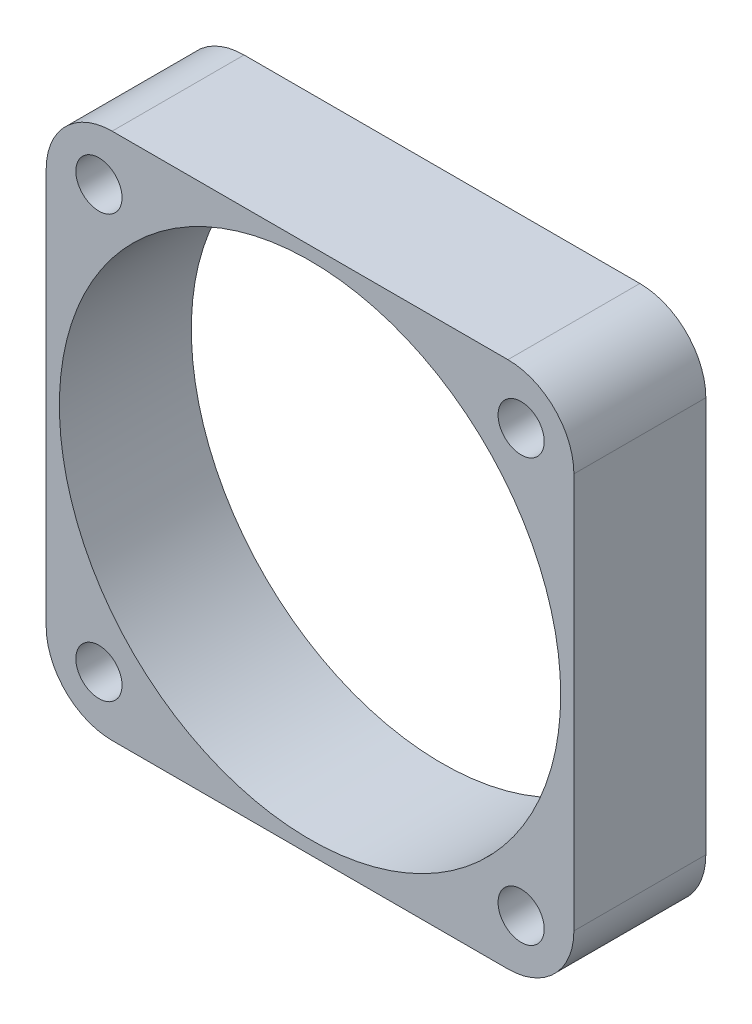
ISO-10303-21;
HEADER;
FILE_DESCRIPTION(('STEP AP214'),'2;1');
FILE_NAME('part.step','',(''),(''),'','','');
FILE_SCHEMA(('AUTOMOTIVE_DESIGN { 1 0 10303 214 1 1 1 1 }'));
ENDSEC;
DATA;
#1=APPLICATION_CONTEXT('core data for automotive mechanical design processes');
#2=APPLICATION_PROTOCOL_DEFINITION('international standard','automotive_design',2000,#1);
#3=PRODUCT_CONTEXT('',#1,'mechanical');
#4=PRODUCT('Part','Part','',(#3));
#5=PRODUCT_RELATED_PRODUCT_CATEGORY('part','',(#4));
#6=PRODUCT_DEFINITION_FORMATION('','',#4);
#7=PRODUCT_DEFINITION_CONTEXT('part definition',#1,'design');
#8=PRODUCT_DEFINITION('design','',#6,#7);
#9=PRODUCT_DEFINITION_SHAPE('','',#8);
#10=(LENGTH_UNIT() NAMED_UNIT(*) SI_UNIT(.MILLI.,.METRE.));
#11=(NAMED_UNIT(*) PLANE_ANGLE_UNIT() SI_UNIT($,.RADIAN.));
#12=(NAMED_UNIT(*) SI_UNIT($,.STERADIAN.) SOLID_ANGLE_UNIT());
#13=UNCERTAINTY_MEASURE_WITH_UNIT(LENGTH_MEASURE(1.E-05),#10,'distance_accuracy_value','');
#14=(GEOMETRIC_REPRESENTATION_CONTEXT(3) GLOBAL_UNCERTAINTY_ASSIGNED_CONTEXT((#13)) GLOBAL_UNIT_ASSIGNED_CONTEXT((#10,
#11,#12)) REPRESENTATION_CONTEXT('',''));
#15=CARTESIAN_POINT('',(0.,0.,0.));
#16=DIRECTION('',(0.,0.,1.));
#17=DIRECTION('',(1.,0.,0.));
#18=AXIS2_PLACEMENT_3D('',#15,#16,#17);
#19=CARTESIAN_POINT('',(0.,0.,10.));
#20=DIRECTION('',(1.,0.,0.));
#21=DIRECTION('',(0.,0.,-1.));
#22=AXIS2_PLACEMENT_3D('',#19,#20,#21);
#23=PLANE('',#22);
#24=DIRECTION('',(0.,-1.,0.));
#25=VECTOR('',#24,1.);
#26=CARTESIAN_POINT('',(0.,0.,0.));
#27=LINE('',#26,#25);
#28=CARTESIAN_POINT('',(0.,35.,0.));
#29=VERTEX_POINT('',#28);
#30=CARTESIAN_POINT('',(0.,5.,0.));
#31=VERTEX_POINT('',#30);
#32=EDGE_CURVE('E177',#29,#31,#27,.T.);
#33=ORIENTED_EDGE('',*,*,#32,.T.);
#34=DIRECTION('',(0.,0.,-1.));
#35=VECTOR('',#34,1.);
#36=CARTESIAN_POINT('',(0.,5.,10.));
#37=LINE('',#36,#35);
#38=CARTESIAN_POINT('',(0.,5.,10.));
#39=VERTEX_POINT('',#38);
#40=EDGE_CURVE('E152',#31,#39,#37,.F.);
#41=ORIENTED_EDGE('',*,*,#40,.T.);
#42=DIRECTION('',(0.,-1.,0.));
#43=VECTOR('',#42,1.);
#44=CARTESIAN_POINT('',(0.,0.,10.));
#45=LINE('',#44,#43);
#46=CARTESIAN_POINT('',(0.,35.,10.));
#47=VERTEX_POINT('',#46);
#48=EDGE_CURVE('E191',#47,#39,#45,.T.);
#49=ORIENTED_EDGE('',*,*,#48,.F.);
#50=DIRECTION('',(0.,0.,-1.));
#51=VECTOR('',#50,1.);
#52=CARTESIAN_POINT('',(0.,35.,10.));
#53=LINE('',#52,#51);
#54=EDGE_CURVE('E158',#47,#29,#53,.T.);
#55=ORIENTED_EDGE('',*,*,#54,.T.);
#56=EDGE_LOOP('',(#33,#41,#49,#55));
#57=FACE_BOUND('',#56,.T.);
#58=ADVANCED_FACE('F68',(#57),#23,.F.);
#59=CARTESIAN_POINT('',(0.,0.,10.));
#60=DIRECTION('',(0.,1.,0.));
#61=DIRECTION('',(0.,0.,1.));
#62=AXIS2_PLACEMENT_3D('',#59,#60,#61);
#63=PLANE('',#62);
#64=DIRECTION('',(1.,0.,0.));
#65=VECTOR('',#64,1.);
#66=CARTESIAN_POINT('',(0.,0.,10.));
#67=LINE('',#66,#65);
#68=CARTESIAN_POINT('',(5.,0.,10.));
#69=VERTEX_POINT('',#68);
#70=CARTESIAN_POINT('',(35.,0.,10.));
#71=VERTEX_POINT('',#70);
#72=EDGE_CURVE('E168',#69,#71,#67,.T.);
#73=ORIENTED_EDGE('',*,*,#72,.F.);
#74=DIRECTION('',(0.,0.,-1.));
#75=VECTOR('',#74,1.);
#76=CARTESIAN_POINT('',(5.,0.,10.));
#77=LINE('',#76,#75);
#78=CARTESIAN_POINT('',(5.,0.,0.));
#79=VERTEX_POINT('',#78);
#80=EDGE_CURVE('E151',#69,#79,#77,.T.);
#81=ORIENTED_EDGE('',*,*,#80,.T.);
#82=DIRECTION('',(1.,0.,0.));
#83=VECTOR('',#82,1.);
#84=CARTESIAN_POINT('',(0.,0.,0.));
#85=LINE('',#84,#83);
#86=CARTESIAN_POINT('',(35.,0.,0.));
#87=VERTEX_POINT('',#86);
#88=EDGE_CURVE('E165',#79,#87,#85,.T.);
#89=ORIENTED_EDGE('',*,*,#88,.T.);
#90=DIRECTION('',(0.,0.,-1.));
#91=VECTOR('',#90,1.);
#92=CARTESIAN_POINT('',(35.,0.,10.));
#93=LINE('',#92,#91);
#94=EDGE_CURVE('E171',#87,#71,#93,.F.);
#95=ORIENTED_EDGE('',*,*,#94,.T.);
#96=EDGE_LOOP('',(#73,#81,#89,#95));
#97=FACE_BOUND('',#96,.T.);
#98=ADVANCED_FACE('F164',(#97),#63,.F.);
#99=CARTESIAN_POINT('',(40.,0.,10.));
#100=DIRECTION('',(-1.,0.,0.));
#101=DIRECTION('',(0.,0.,1.));
#102=AXIS2_PLACEMENT_3D('',#99,#100,#101);
#103=PLANE('',#102);
#104=DIRECTION('',(0.,1.,0.));
#105=VECTOR('',#104,1.);
#106=CARTESIAN_POINT('',(40.,0.,10.));
#107=LINE('',#106,#105);
#108=CARTESIAN_POINT('',(40.,5.,10.));
#109=VERTEX_POINT('',#108);
#110=CARTESIAN_POINT('',(40.,35.,10.));
#111=VERTEX_POINT('',#110);
#112=EDGE_CURVE('E239',#109,#111,#107,.T.);
#113=ORIENTED_EDGE('',*,*,#112,.F.);
#114=DIRECTION('',(0.,0.,-1.));
#115=VECTOR('',#114,1.);
#116=CARTESIAN_POINT('',(40.,5.,10.));
#117=LINE('',#116,#115);
#118=CARTESIAN_POINT('',(40.,5.,0.));
#119=VERTEX_POINT('',#118);
#120=EDGE_CURVE('E219',#109,#119,#117,.T.);
#121=ORIENTED_EDGE('',*,*,#120,.T.);
#122=DIRECTION('',(0.,1.,0.));
#123=VECTOR('',#122,1.);
#124=CARTESIAN_POINT('',(40.,0.,0.));
#125=LINE('',#124,#123);
#126=CARTESIAN_POINT('',(40.,35.,0.));
#127=VERTEX_POINT('',#126);
#128=EDGE_CURVE('E176',#119,#127,#125,.T.);
#129=ORIENTED_EDGE('',*,*,#128,.T.);
#130=DIRECTION('',(0.,0.,-1.));
#131=VECTOR('',#130,1.);
#132=CARTESIAN_POINT('',(40.,35.,10.));
#133=LINE('',#132,#131);
#134=EDGE_CURVE('E216',#127,#111,#133,.F.);
#135=ORIENTED_EDGE('',*,*,#134,.T.);
#136=EDGE_LOOP('',(#113,#121,#129,#135));
#137=FACE_BOUND('',#136,.T.);
#138=ADVANCED_FACE('F258',(#137),#103,.F.);
#139=CARTESIAN_POINT('',(0.,40.,10.));
#140=DIRECTION('',(0.,-1.,0.));
#141=DIRECTION('',(0.,0.,-1.));
#142=AXIS2_PLACEMENT_3D('',#139,#140,#141);
#143=PLANE('',#142);
#144=DIRECTION('',(-1.,0.,0.));
#145=VECTOR('',#144,1.);
#146=CARTESIAN_POINT('',(0.,40.,0.));
#147=LINE('',#146,#145);
#148=CARTESIAN_POINT('',(35.,40.,0.));
#149=VERTEX_POINT('',#148);
#150=CARTESIAN_POINT('',(5.,40.,0.));
#151=VERTEX_POINT('',#150);
#152=EDGE_CURVE('E182',#149,#151,#147,.T.);
#153=ORIENTED_EDGE('',*,*,#152,.T.);
#154=DIRECTION('',(0.,0.,-1.));
#155=VECTOR('',#154,1.);
#156=CARTESIAN_POINT('',(5.,40.,10.));
#157=LINE('',#156,#155);
#158=CARTESIAN_POINT('',(5.,40.,10.));
#159=VERTEX_POINT('',#158);
#160=EDGE_CURVE('E12',#151,#159,#157,.F.);
#161=ORIENTED_EDGE('',*,*,#160,.T.);
#162=DIRECTION('',(-1.,0.,0.));
#163=VECTOR('',#162,1.);
#164=CARTESIAN_POINT('',(0.,40.,10.));
#165=LINE('',#164,#163);
#166=CARTESIAN_POINT('',(35.,40.,10.));
#167=VERTEX_POINT('',#166);
#168=EDGE_CURVE('E193',#167,#159,#165,.T.);
#169=ORIENTED_EDGE('',*,*,#168,.F.);
#170=DIRECTION('',(0.,0.,-1.));
#171=VECTOR('',#170,1.);
#172=CARTESIAN_POINT('',(35.,40.,10.));
#173=LINE('',#172,#171);
#174=EDGE_CURVE('E76',#167,#149,#173,.T.);
#175=ORIENTED_EDGE('',*,*,#174,.T.);
#176=EDGE_LOOP('',(#153,#161,#169,#175));
#177=FACE_BOUND('',#176,.T.);
#178=ADVANCED_FACE('F227',(#177),#143,.F.);
#179=CARTESIAN_POINT('',(0.,0.,10.));
#180=DIRECTION('',(0.,0.,-1.));
#181=DIRECTION('',(-1.,0.,0.));
#182=AXIS2_PLACEMENT_3D('',#179,#180,#181);
#183=PLANE('',#182);
#184=CARTESIAN_POINT('',(36.,36.,10.));
#185=DIRECTION('',(0.,0.,1.));
#186=DIRECTION('',(1.,0.,0.));
#187=AXIS2_PLACEMENT_3D('',#184,#185,#186);
#188=CIRCLE('',#187,1.75);
#189=CARTESIAN_POINT('',(37.75,36.,10.));
#190=VERTEX_POINT('',#189);
#191=EDGE_CURVE('E427',#190,#190,#188,.T.);
#192=ORIENTED_EDGE('',*,*,#191,.F.);
#193=EDGE_LOOP('',(#192));
#194=FACE_BOUND('',#193,.T.);
#195=CARTESIAN_POINT('',(36.,4.,10.));
#196=DIRECTION('',(0.,0.,1.));
#197=DIRECTION('',(1.,0.,0.));
#198=AXIS2_PLACEMENT_3D('',#195,#196,#197);
#199=CIRCLE('',#198,1.75);
#200=CARTESIAN_POINT('',(37.75,4.,10.));
#201=VERTEX_POINT('',#200);
#202=EDGE_CURVE('E419',#201,#201,#199,.T.);
#203=ORIENTED_EDGE('',*,*,#202,.F.);
#204=EDGE_LOOP('',(#203));
#205=FACE_BOUND('',#204,.T.);
#206=CARTESIAN_POINT('',(3.99999999999999,4.,10.));
#207=DIRECTION('',(0.,0.,1.));
#208=DIRECTION('',(1.,0.,0.));
#209=AXIS2_PLACEMENT_3D('',#206,#207,#208);
#210=CIRCLE('',#209,1.75);
#211=CARTESIAN_POINT('',(5.74999999999999,4.,10.));
#212=VERTEX_POINT('',#211);
#213=EDGE_CURVE('E411',#212,#212,#210,.T.);
#214=ORIENTED_EDGE('',*,*,#213,.F.);
#215=EDGE_LOOP('',(#214));
#216=FACE_BOUND('',#215,.T.);
#217=CARTESIAN_POINT('',(3.99999999999999,36.,10.));
#218=DIRECTION('',(0.,0.,1.));
#219=DIRECTION('',(1.,0.,0.));
#220=AXIS2_PLACEMENT_3D('',#217,#218,#219);
#221=CIRCLE('',#220,1.75);
#222=CARTESIAN_POINT('',(5.75,36.,10.));
#223=VERTEX_POINT('',#222);
#224=EDGE_CURVE('E402',#223,#223,#221,.T.);
#225=ORIENTED_EDGE('',*,*,#224,.F.);
#226=EDGE_LOOP('',(#225));
#227=FACE_BOUND('',#226,.T.);
#228=CARTESIAN_POINT('',(20.,20.,10.));
#229=DIRECTION('',(0.,0.,1.));
#230=DIRECTION('',(1.,0.,0.));
#231=AXIS2_PLACEMENT_3D('',#228,#229,#230);
#232=CIRCLE('',#231,19.);
#233=CARTESIAN_POINT('',(39.,20.,10.));
#234=VERTEX_POINT('',#233);
#235=EDGE_CURVE('E242',#234,#234,#232,.T.);
#236=ORIENTED_EDGE('',*,*,#235,.F.);
#237=EDGE_LOOP('',(#236));
#238=FACE_BOUND('',#237,.T.);
#239=ORIENTED_EDGE('',*,*,#48,.T.);
#240=CARTESIAN_POINT('',(5.,5.,10.));
#241=DIRECTION('',(0.,0.,-1.));
#242=DIRECTION('',(-1.,0.,0.));
#243=AXIS2_PLACEMENT_3D('',#240,#241,#242);
#244=CIRCLE('',#243,5.);
#245=EDGE_CURVE('E213',#39,#69,#244,.F.);
#246=ORIENTED_EDGE('',*,*,#245,.T.);
#247=ORIENTED_EDGE('',*,*,#72,.T.);
#248=CARTESIAN_POINT('',(35.,5.,10.));
#249=DIRECTION('',(0.,0.,-1.));
#250=DIRECTION('',(-1.,0.,0.));
#251=AXIS2_PLACEMENT_3D('',#248,#249,#250);
#252=CIRCLE('',#251,5.);
#253=EDGE_CURVE('E210',#71,#109,#252,.F.);
#254=ORIENTED_EDGE('',*,*,#253,.T.);
#255=ORIENTED_EDGE('',*,*,#112,.T.);
#256=CARTESIAN_POINT('',(35.,35.,10.));
#257=DIRECTION('',(0.,0.,-1.));
#258=DIRECTION('',(-1.,0.,0.));
#259=AXIS2_PLACEMENT_3D('',#256,#257,#258);
#260=CIRCLE('',#259,5.);
#261=EDGE_CURVE('E91',#111,#167,#260,.F.);
#262=ORIENTED_EDGE('',*,*,#261,.T.);
#263=ORIENTED_EDGE('',*,*,#168,.T.);
#264=CARTESIAN_POINT('',(5.,35.,10.));
#265=DIRECTION('',(0.,0.,-1.));
#266=DIRECTION('',(-1.,0.,0.));
#267=AXIS2_PLACEMENT_3D('',#264,#265,#266);
#268=CIRCLE('',#267,5.);
#269=EDGE_CURVE('E208',#159,#47,#268,.F.);
#270=ORIENTED_EDGE('',*,*,#269,.T.);
#271=EDGE_LOOP('',(#239,#246,#247,#254,#255,#262,#263,#270));
#272=FACE_BOUND('',#271,.T.);
#273=ADVANCED_FACE('F247',(#194,#205,#216,#227,#238,#272),#183,.F.);
#274=CARTESIAN_POINT('',(0.,0.,0.));
#275=DIRECTION('',(0.,0.,-1.));
#276=DIRECTION('',(-1.,0.,0.));
#277=AXIS2_PLACEMENT_3D('',#274,#275,#276);
#278=PLANE('',#277);
#279=CARTESIAN_POINT('',(36.,36.,0.));
#280=DIRECTION('',(0.,0.,1.));
#281=DIRECTION('',(1.,0.,0.));
#282=AXIS2_PLACEMENT_3D('',#279,#280,#281);
#283=CIRCLE('',#282,1.75);
#284=CARTESIAN_POINT('',(37.75,36.,0.));
#285=VERTEX_POINT('',#284);
#286=EDGE_CURVE('E423',#285,#285,#283,.T.);
#287=ORIENTED_EDGE('',*,*,#286,.T.);
#288=EDGE_LOOP('',(#287));
#289=FACE_BOUND('',#288,.T.);
#290=CARTESIAN_POINT('',(36.,4.,0.));
#291=DIRECTION('',(0.,0.,1.));
#292=DIRECTION('',(1.,0.,0.));
#293=AXIS2_PLACEMENT_3D('',#290,#291,#292);
#294=CIRCLE('',#293,1.75);
#295=CARTESIAN_POINT('',(37.75,4.,0.));
#296=VERTEX_POINT('',#295);
#297=EDGE_CURVE('E415',#296,#296,#294,.T.);
#298=ORIENTED_EDGE('',*,*,#297,.T.);
#299=EDGE_LOOP('',(#298));
#300=FACE_BOUND('',#299,.T.);
#301=CARTESIAN_POINT('',(3.99999999999999,4.,0.));
#302=DIRECTION('',(0.,0.,1.));
#303=DIRECTION('',(1.,0.,0.));
#304=AXIS2_PLACEMENT_3D('',#301,#302,#303);
#305=CIRCLE('',#304,1.75);
#306=CARTESIAN_POINT('',(5.74999999999999,4.,0.));
#307=VERTEX_POINT('',#306);
#308=EDGE_CURVE('E408',#307,#307,#305,.T.);
#309=ORIENTED_EDGE('',*,*,#308,.T.);
#310=EDGE_LOOP('',(#309));
#311=FACE_BOUND('',#310,.T.);
#312=CARTESIAN_POINT('',(3.99999999999999,36.,0.));
#313=DIRECTION('',(0.,0.,1.));
#314=DIRECTION('',(1.,0.,0.));
#315=AXIS2_PLACEMENT_3D('',#312,#313,#314);
#316=CIRCLE('',#315,1.75);
#317=CARTESIAN_POINT('',(5.75,36.,0.));
#318=VERTEX_POINT('',#317);
#319=EDGE_CURVE('E398',#318,#318,#316,.T.);
#320=ORIENTED_EDGE('',*,*,#319,.T.);
#321=EDGE_LOOP('',(#320));
#322=FACE_BOUND('',#321,.T.);
#323=CARTESIAN_POINT('',(20.,20.,0.));
#324=DIRECTION('',(0.,0.,1.));
#325=DIRECTION('',(1.,0.,0.));
#326=AXIS2_PLACEMENT_3D('',#323,#324,#325);
#327=CIRCLE('',#326,19.);
#328=CARTESIAN_POINT('',(39.,20.,0.));
#329=VERTEX_POINT('',#328);
#330=EDGE_CURVE('E185',#329,#329,#327,.T.);
#331=ORIENTED_EDGE('',*,*,#330,.T.);
#332=EDGE_LOOP('',(#331));
#333=FACE_BOUND('',#332,.T.);
#334=ORIENTED_EDGE('',*,*,#88,.F.);
#335=CARTESIAN_POINT('',(5.,5.,0.));
#336=DIRECTION('',(0.,0.,-1.));
#337=DIRECTION('',(-1.,0.,0.));
#338=AXIS2_PLACEMENT_3D('',#335,#336,#337);
#339=CIRCLE('',#338,5.);
#340=EDGE_CURVE('E147',#79,#31,#339,.T.);
#341=ORIENTED_EDGE('',*,*,#340,.T.);
#342=ORIENTED_EDGE('',*,*,#32,.F.);
#343=CARTESIAN_POINT('',(5.,35.,0.));
#344=DIRECTION('',(0.,0.,-1.));
#345=DIRECTION('',(-1.,0.,0.));
#346=AXIS2_PLACEMENT_3D('',#343,#344,#345);
#347=CIRCLE('',#346,5.);
#348=EDGE_CURVE('E197',#29,#151,#347,.T.);
#349=ORIENTED_EDGE('',*,*,#348,.T.);
#350=ORIENTED_EDGE('',*,*,#152,.F.);
#351=CARTESIAN_POINT('',(35.,35.,0.));
#352=DIRECTION('',(0.,0.,-1.));
#353=DIRECTION('',(-1.,0.,0.));
#354=AXIS2_PLACEMENT_3D('',#351,#352,#353);
#355=CIRCLE('',#354,5.);
#356=EDGE_CURVE('E170',#149,#127,#355,.T.);
#357=ORIENTED_EDGE('',*,*,#356,.T.);
#358=ORIENTED_EDGE('',*,*,#128,.F.);
#359=CARTESIAN_POINT('',(35.,5.,0.));
#360=DIRECTION('',(0.,0.,-1.));
#361=DIRECTION('',(-1.,0.,0.));
#362=AXIS2_PLACEMENT_3D('',#359,#360,#361);
#363=CIRCLE('',#362,5.);
#364=EDGE_CURVE('E159',#119,#87,#363,.T.);
#365=ORIENTED_EDGE('',*,*,#364,.T.);
#366=EDGE_LOOP('',(#334,#341,#342,#349,#350,#357,#358,#365));
#367=FACE_BOUND('',#366,.T.);
#368=ADVANCED_FACE('F173',(#289,#300,#311,#322,#333,#367),#278,.T.);
#369=CARTESIAN_POINT('',(20.,20.,0.));
#370=DIRECTION('',(0.,0.,1.));
#371=DIRECTION('',(1.,0.,0.));
#372=AXIS2_PLACEMENT_3D('',#369,#370,#371);
#373=CYLINDRICAL_SURFACE('',#372,19.);
#374=ORIENTED_EDGE('',*,*,#330,.F.);
#375=EDGE_LOOP('',(#374));
#376=FACE_BOUND('',#375,.T.);
#377=ORIENTED_EDGE('',*,*,#235,.T.);
#378=EDGE_LOOP('',(#377));
#379=FACE_BOUND('',#378,.T.);
#380=ADVANCED_FACE('F255',(#376,#379),#373,.F.);
#381=CARTESIAN_POINT('',(3.99999999999999,36.,0.));
#382=DIRECTION('',(0.,0.,1.));
#383=DIRECTION('',(1.,0.,0.));
#384=AXIS2_PLACEMENT_3D('',#381,#382,#383);
#385=CYLINDRICAL_SURFACE('',#384,1.75);
#386=ORIENTED_EDGE('',*,*,#319,.F.);
#387=EDGE_LOOP('',(#386));
#388=FACE_BOUND('',#387,.T.);
#389=ORIENTED_EDGE('',*,*,#224,.T.);
#390=EDGE_LOOP('',(#389));
#391=FACE_BOUND('',#390,.T.);
#392=ADVANCED_FACE('F354',(#388,#391),#385,.F.);
#393=CARTESIAN_POINT('',(3.99999999999999,4.,0.));
#394=DIRECTION('',(0.,0.,1.));
#395=DIRECTION('',(1.,0.,0.));
#396=AXIS2_PLACEMENT_3D('',#393,#394,#395);
#397=CYLINDRICAL_SURFACE('',#396,1.75);
#398=ORIENTED_EDGE('',*,*,#308,.F.);
#399=EDGE_LOOP('',(#398));
#400=FACE_BOUND('',#399,.T.);
#401=ORIENTED_EDGE('',*,*,#213,.T.);
#402=EDGE_LOOP('',(#401));
#403=FACE_BOUND('',#402,.T.);
#404=ADVANCED_FACE('F346',(#400,#403),#397,.F.);
#405=CARTESIAN_POINT('',(36.,4.,0.));
#406=DIRECTION('',(0.,0.,1.));
#407=DIRECTION('',(1.,0.,0.));
#408=AXIS2_PLACEMENT_3D('',#405,#406,#407);
#409=CYLINDRICAL_SURFACE('',#408,1.75);
#410=ORIENTED_EDGE('',*,*,#297,.F.);
#411=EDGE_LOOP('',(#410));
#412=FACE_BOUND('',#411,.T.);
#413=ORIENTED_EDGE('',*,*,#202,.T.);
#414=EDGE_LOOP('',(#413));
#415=FACE_BOUND('',#414,.T.);
#416=ADVANCED_FACE('F338',(#412,#415),#409,.F.);
#417=CARTESIAN_POINT('',(36.,36.,0.));
#418=DIRECTION('',(0.,0.,1.));
#419=DIRECTION('',(1.,0.,0.));
#420=AXIS2_PLACEMENT_3D('',#417,#418,#419);
#421=CYLINDRICAL_SURFACE('',#420,1.75);
#422=ORIENTED_EDGE('',*,*,#286,.F.);
#423=EDGE_LOOP('',(#422));
#424=FACE_BOUND('',#423,.T.);
#425=ORIENTED_EDGE('',*,*,#191,.T.);
#426=EDGE_LOOP('',(#425));
#427=FACE_BOUND('',#426,.T.);
#428=ADVANCED_FACE('F274',(#424,#427),#421,.F.);
#429=CARTESIAN_POINT('',(5.,5.,10.));
#430=DIRECTION('',(0.,0.,-1.));
#431=DIRECTION('',(-1.,0.,0.));
#432=AXIS2_PLACEMENT_3D('',#429,#430,#431);
#433=CYLINDRICAL_SURFACE('',#432,5.);
#434=ORIENTED_EDGE('',*,*,#245,.F.);
#435=ORIENTED_EDGE('',*,*,#40,.F.);
#436=ORIENTED_EDGE('',*,*,#340,.F.);
#437=ORIENTED_EDGE('',*,*,#80,.F.);
#438=EDGE_LOOP('',(#434,#435,#436,#437));
#439=FACE_BOUND('',#438,.T.);
#440=ADVANCED_FACE('F150',(#439),#433,.T.);
#441=CARTESIAN_POINT('',(35.,5.,10.));
#442=DIRECTION('',(0.,0.,-1.));
#443=DIRECTION('',(-1.,0.,0.));
#444=AXIS2_PLACEMENT_3D('',#441,#442,#443);
#445=CYLINDRICAL_SURFACE('',#444,5.);
#446=ORIENTED_EDGE('',*,*,#253,.F.);
#447=ORIENTED_EDGE('',*,*,#94,.F.);
#448=ORIENTED_EDGE('',*,*,#364,.F.);
#449=ORIENTED_EDGE('',*,*,#120,.F.);
#450=EDGE_LOOP('',(#446,#447,#448,#449));
#451=FACE_BOUND('',#450,.T.);
#452=ADVANCED_FACE('F273',(#451),#445,.T.);
#453=CARTESIAN_POINT('',(5.,35.,10.));
#454=DIRECTION('',(0.,0.,-1.));
#455=DIRECTION('',(-1.,0.,0.));
#456=AXIS2_PLACEMENT_3D('',#453,#454,#455);
#457=CYLINDRICAL_SURFACE('',#456,5.);
#458=ORIENTED_EDGE('',*,*,#269,.F.);
#459=ORIENTED_EDGE('',*,*,#160,.F.);
#460=ORIENTED_EDGE('',*,*,#348,.F.);
#461=ORIENTED_EDGE('',*,*,#54,.F.);
#462=EDGE_LOOP('',(#458,#459,#460,#461));
#463=FACE_BOUND('',#462,.T.);
#464=ADVANCED_FACE('F232',(#463),#457,.T.);
#465=CARTESIAN_POINT('',(35.,35.,10.));
#466=DIRECTION('',(0.,0.,-1.));
#467=DIRECTION('',(-1.,0.,0.));
#468=AXIS2_PLACEMENT_3D('',#465,#466,#467);
#469=CYLINDRICAL_SURFACE('',#468,5.);
#470=ORIENTED_EDGE('',*,*,#261,.F.);
#471=ORIENTED_EDGE('',*,*,#134,.F.);
#472=ORIENTED_EDGE('',*,*,#356,.F.);
#473=ORIENTED_EDGE('',*,*,#174,.F.);
#474=EDGE_LOOP('',(#470,#471,#472,#473));
#475=FACE_BOUND('',#474,.T.);
#476=ADVANCED_FACE('F70',(#475),#469,.T.);
#477=CLOSED_SHELL('',(#58,#98,#138,#178,#273,#368,#380,#392,#404,#416,#428,#440,#452,#464,#476));
#478=MANIFOLD_SOLID_BREP('B2',#477);
#479=ADVANCED_BREP_SHAPE_REPRESENTATION('',(#18,#478),#14);
#480=SHAPE_DEFINITION_REPRESENTATION(#9,#479);
ENDSEC;
END-ISO-10303-21;
